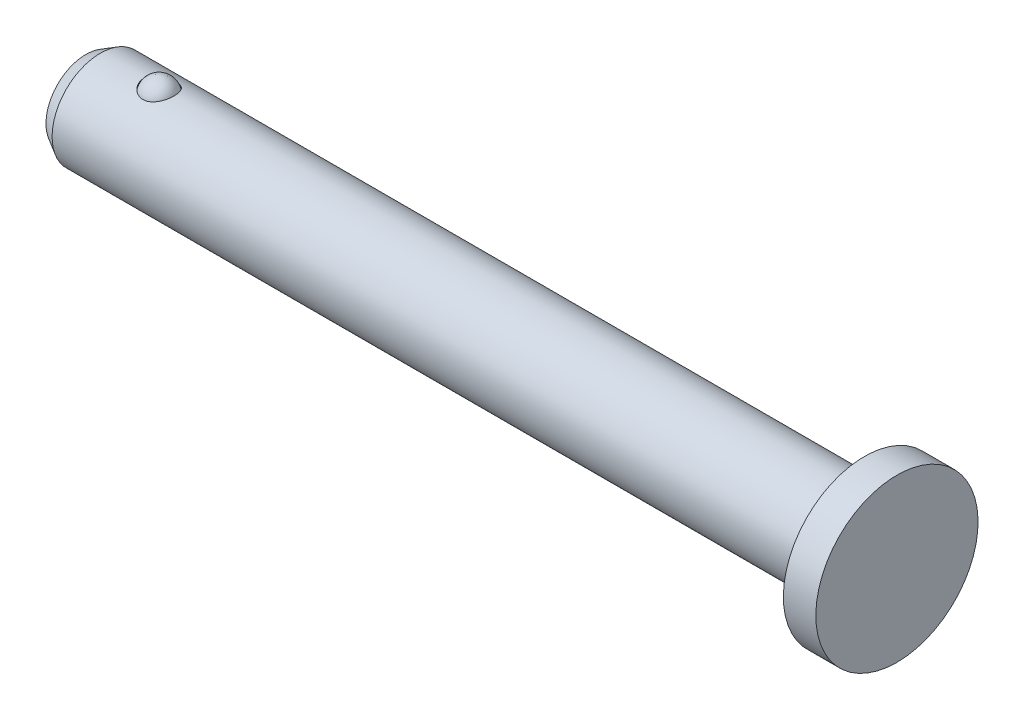
ISO-10303-21;
HEADER;
FILE_DESCRIPTION(('STEP AP214'),'2;1');
FILE_NAME('part.step','',(''),(''),'','','');
FILE_SCHEMA(('AUTOMOTIVE_DESIGN { 1 0 10303 214 1 1 1 1 }'));
ENDSEC;
DATA;
#1=APPLICATION_CONTEXT('core data for automotive mechanical design processes');
#2=APPLICATION_PROTOCOL_DEFINITION('international standard','automotive_design',2000,#1);
#3=PRODUCT_CONTEXT('',#1,'mechanical');
#4=PRODUCT('Part','Part','',(#3));
#5=PRODUCT_RELATED_PRODUCT_CATEGORY('part','',(#4));
#6=PRODUCT_DEFINITION_FORMATION('','',#4);
#7=PRODUCT_DEFINITION_CONTEXT('part definition',#1,'design');
#8=PRODUCT_DEFINITION('design','',#6,#7);
#9=PRODUCT_DEFINITION_SHAPE('','',#8);
#10=(LENGTH_UNIT() NAMED_UNIT(*) SI_UNIT(.MILLI.,.METRE.));
#11=(NAMED_UNIT(*) PLANE_ANGLE_UNIT() SI_UNIT($,.RADIAN.));
#12=(NAMED_UNIT(*) SI_UNIT($,.STERADIAN.) SOLID_ANGLE_UNIT());
#13=UNCERTAINTY_MEASURE_WITH_UNIT(LENGTH_MEASURE(1.E-05),#10,'distance_accuracy_value','');
#14=(GEOMETRIC_REPRESENTATION_CONTEXT(3) GLOBAL_UNCERTAINTY_ASSIGNED_CONTEXT((#13)) GLOBAL_UNIT_ASSIGNED_CONTEXT((#10,
#11,#12)) REPRESENTATION_CONTEXT('',''));
#15=CARTESIAN_POINT('',(0.,0.,0.));
#16=DIRECTION('',(0.,0.,1.));
#17=DIRECTION('',(1.,0.,0.));
#18=AXIS2_PLACEMENT_3D('',#15,#16,#17);
#19=CARTESIAN_POINT('',(-19.84375,0.,0.));
#20=DIRECTION('',(-1.,0.,0.));
#21=DIRECTION('',(0.,-1.,0.));
#22=AXIS2_PLACEMENT_3D('',#19,#20,#21);
#23=CYLINDRICAL_SURFACE('',#22,2.3622);
#24=CARTESIAN_POINT('',(-19.13509,0.,0.));
#25=DIRECTION('',(-1.,0.,0.));
#26=DIRECTION('',(0.,-1.,0.));
#27=AXIS2_PLACEMENT_3D('',#24,#25,#26);
#28=CIRCLE('',#27,2.3622);
#29=CARTESIAN_POINT('',(-19.13509,-2.3622,0.));
#30=VERTEX_POINT('',#29);
#31=EDGE_CURVE('P0_E27',#30,#30,#28,.T.);
#32=ORIENTED_EDGE('',*,*,#31,.F.);
#33=EDGE_LOOP('',(#32));
#34=FACE_BOUND('',#33,.T.);
#35=CARTESIAN_POINT('',(18.25625,0.,0.));
#36=DIRECTION('',(-1.,0.,0.));
#37=DIRECTION('',(0.,-1.,0.));
#38=AXIS2_PLACEMENT_3D('',#35,#36,#37);
#39=CIRCLE('',#38,2.3622);
#40=CARTESIAN_POINT('',(18.25625,-2.3622,0.));
#41=VERTEX_POINT('',#40);
#42=EDGE_CURVE('P0_E10',#41,#41,#39,.T.);
#43=ORIENTED_EDGE('',*,*,#42,.T.);
#44=EDGE_LOOP('',(#43));
#45=FACE_BOUND('',#44,.T.);
#46=CARTESIAN_POINT('',(-16.26235,2.22581604673215,-0.791032089178223));
#47=CARTESIAN_POINT('',(-16.3018338222643,2.22581576398312,-0.791032519638611));
#48=CARTESIAN_POINT('',(-16.3413151384197,2.22697971671572,-0.787780239460785));
#49=CARTESIAN_POINT('',(-16.4190911852111,2.23149491079169,-0.774896744356573));
#50=CARTESIAN_POINT('',(-16.4573858392532,2.2348462930174,-0.765265118565094));
#51=CARTESIAN_POINT('',(-16.531633713184,2.24333848583653,-0.739997800068515));
#52=CARTESIAN_POINT('',(-16.5675913296129,2.24847581373636,-0.724373786774381));
#53=CARTESIAN_POINT('',(-16.6363604141592,2.25998083212616,-0.687636848342259));
#54=CARTESIAN_POINT('',(-16.6691713829048,2.26634871742327,-0.666523053944658));
#55=CARTESIAN_POINT('',(-16.7319315200548,2.27988127975236,-0.618680689218365));
#56=CARTESIAN_POINT('',(-16.7617565640189,2.28706485050395,-0.59179497242801));
#57=CARTESIAN_POINT('',(-16.8167458077474,2.30133787147742,-0.533600878356375));
#58=CARTESIAN_POINT('',(-16.8419088865026,2.30842729868224,-0.502291440535603));
#59=CARTESIAN_POINT('',(-16.88866080437,2.32229610981989,-0.433849997368854));
#60=CARTESIAN_POINT('',(-16.9099016466427,2.32902369976236,-0.396469482014577));
#61=CARTESIAN_POINT('',(-16.9462545129409,2.34094584755715,-0.318610784362629));
#62=CARTESIAN_POINT('',(-16.9613651181152,2.34614005042941,-0.278131887514649));
#63=CARTESIAN_POINT('',(-16.9857004779035,2.3546627054261,-0.193473280151713));
#64=CARTESIAN_POINT('',(-16.9946653937695,2.35790814356074,-0.149210288520307));
#65=CARTESIAN_POINT('',(-17.005565894284,2.36186996349137,-0.0597154884593806));
#66=CARTESIAN_POINT('',(-17.0075008699652,2.36258612618922,-0.0144835964404188));
#67=CARTESIAN_POINT('',(-17.0042909971991,2.36141021290238,0.0762430533264944));
#68=CARTESIAN_POINT('',(-16.9990605263757,2.35948659277288,0.12173440739389));
#69=CARTESIAN_POINT('',(-16.9814508372294,2.35317206611294,0.211137527329617));
#70=CARTESIAN_POINT('',(-16.9690713024393,2.34878105035866,0.255049223179884));
#71=CARTESIAN_POINT('',(-16.9373785333382,2.33799474034002,0.340003755419017));
#72=CARTESIAN_POINT('',(-16.9180697195015,2.33160072420234,0.381048400920872));
#73=CARTESIAN_POINT('',(-16.8728542738949,2.31749884585933,0.459087628468663));
#74=CARTESIAN_POINT('',(-16.8469476298871,2.30979098121703,0.49608220300213));
#75=CARTESIAN_POINT('',(-16.7895191404422,2.2940716483114,0.564297213422603));
#76=CARTESIAN_POINT('',(-16.7580957761656,2.28606718272386,0.59560198834643));
#77=CARTESIAN_POINT('',(-16.6900563583582,2.27059247122217,0.65211919780701));
#78=CARTESIAN_POINT('',(-16.6534418764304,2.26312206464838,0.677333470010341));
#79=CARTESIAN_POINT('',(-16.5779492741709,2.25001785060625,0.719636287127462));
#80=CARTESIAN_POINT('',(-16.5392775456061,2.24431058256401,0.73706966099699));
#81=CARTESIAN_POINT('',(-16.4592512672779,2.23497292980211,0.764920542936363));
#82=CARTESIAN_POINT('',(-16.4178981594483,2.23134143896186,0.775341788088755));
#83=CARTESIAN_POINT('',(-16.336791790642,2.22680429519513,0.788273335332938));
#84=CARTESIAN_POINT('',(-16.2971273529941,2.2257265947787,0.791283526133024));
#85=CARTESIAN_POINT('',(-16.2178529464748,2.2259171339851,0.790747912230159));
#86=CARTESIAN_POINT('',(-16.1782429675224,2.227184856437,0.787203552820129));
#87=CARTESIAN_POINT('',(-16.101593807461,2.23183155461559,0.77392686631853));
#88=CARTESIAN_POINT('',(-16.0645129744794,2.23513795566731,0.764407057193666));
#89=CARTESIAN_POINT('',(-15.9924941222932,2.24343404277332,0.739703383423265));
#90=CARTESIAN_POINT('',(-15.9575563106065,2.24842389153994,0.724518971254892));
#91=CARTESIAN_POINT('',(-15.8896511257475,2.25973866548061,0.688430400089749));
#92=CARTESIAN_POINT('',(-15.8567728995766,2.26609879126542,0.667369988967333));
#93=CARTESIAN_POINT('',(-15.7948539005421,2.27941389290418,0.620368260180015));
#94=CARTESIAN_POINT('',(-15.7658141812176,2.28636903120949,0.594425607222328));
#95=CARTESIAN_POINT('',(-15.7103363875522,2.30067315029258,0.53650441012868));
#96=CARTESIAN_POINT('',(-15.6841940827522,2.30801802589022,0.504241497413384));
#97=CARTESIAN_POINT('',(-15.6373294223548,2.3219066096982,0.435840003810775));
#98=CARTESIAN_POINT('',(-15.6166085654881,2.32845009610334,0.399700355105054));
#99=CARTESIAN_POINT('',(-15.5799154074514,2.34044485511104,0.322365815909071));
#100=CARTESIAN_POINT('',(-15.5642733166028,2.34581462134006,0.281001264451536));
#101=CARTESIAN_POINT('',(-15.5396525932013,2.35443088539652,0.196122971548608));
#102=CARTESIAN_POINT('',(-15.5306749478103,2.35767706866266,0.152608912728051));
#103=CARTESIAN_POINT('',(-15.5193857562819,2.36177692867522,0.0635170638966761));
#104=CARTESIAN_POINT('',(-15.5172440137684,2.36256964717617,0.0179148433694454));
#105=CARTESIAN_POINT('',(-15.520139881845,2.3615088375365,-0.0730313594257117));
#106=CARTESIAN_POINT('',(-15.5251778997728,2.35965515925471,-0.118375326895323));
#107=CARTESIAN_POINT('',(-15.5423917858139,2.35347668943244,-0.207728305434119));
#108=CARTESIAN_POINT('',(-15.5545996260354,2.34914083140647,-0.251730402335729));
#109=CARTESIAN_POINT('',(-15.5859777734291,2.33844323829137,-0.33692140450069));
#110=CARTESIAN_POINT('',(-15.6051483348,2.33208142923882,-0.378110206989596));
#111=CARTESIAN_POINT('',(-15.6499743354645,2.31806542607961,-0.456209651369723));
#112=CARTESIAN_POINT('',(-15.6755888264204,2.31041949036449,-0.493145237461023));
#113=CARTESIAN_POINT('',(-15.7328670809521,2.29467177360045,-0.561885478042451));
#114=CARTESIAN_POINT('',(-15.7645302727704,2.28657003568757,-0.593690616967873));
#115=CARTESIAN_POINT('',(-15.8321103675284,2.27114006586694,-0.65018826947417));
#116=CARTESIAN_POINT('',(-15.8678630627565,2.26379555842983,-0.675072287191636));
#117=CARTESIAN_POINT('',(-15.9434509291089,2.25051576769323,-0.718107031490448));
#118=CARTESIAN_POINT('',(-15.9832838483709,2.24457971300892,-0.736261446834664));
#119=CARTESIAN_POINT('',(-16.0625351985796,2.23529527948482,-0.763964093369265));
#120=CARTESIAN_POINT('',(-16.1017351816544,2.23177879622831,-0.77408143316942));
#121=CARTESIAN_POINT('',(-16.1814079558051,2.22703972798425,-0.787614032349747));
#122=CARTESIAN_POINT('',(-16.221880294314,2.22581633654123,-0.79103164796954));
#123=CARTESIAN_POINT('',(-16.26235,2.22581604673215,-0.791032089178223));
#124=B_SPLINE_CURVE_WITH_KNOTS('',3,(#46,#47,#48,#49,#50,#51,#52,#53,#54,#55,#56,#57,#58,#59,
#60,#61,#62,#63,#64,#65,#66,#67,#68,#69,#70,#71,#72,#73,#74,#75,#76,#77,#78,#79,#80,#81,#82,#83,
#84,#85,#86,#87,#88,#89,#90,#91,#92,#93,#94,#95,#96,#97,#98,#99,#100,#101,#102,#103,#104,#105,
#106,#107,#108,#109,#110,#111,#112,#113,#114,#115,#116,#117,#118,#119,#120,#121,#122,#123),
.UNSPECIFIED.,.T.,.F.,(4,2,2,2,2,2,2,2,2,2,2,2,2,2,2,2,2,2,2,2,2,2,2,2,2,2,2,2,2,2,2,2,2,2,2,2,
2,2,4),(0.,0.118299361509028,0.236606342891336,0.354683901324815,0.472780167721913,
0.594630449676335,0.716509993647939,0.846477480289179,0.976475030932797,1.11167665655919,
1.24688999372124,1.38373321192027,1.52058248821507,1.65734461742627,1.79410700031295,
1.92863866932185,2.06312969570307,2.19085824756083,2.31851867302866,2.43729849240827,
2.55605212369601,2.6708045306772,2.78556803214262,2.90373452362426,3.02193338072498,
3.14788853933123,3.27387848087818,3.40691156896659,3.53996435847092,3.67629744685247,
3.81263827028837,3.94959173936421,4.08655020891101,4.22265943045034,4.35875579253439,
4.49059132495186,4.62235448583304,4.74365036609798,4.86490357990958),.UNSPECIFIED.);
#125=CARTESIAN_POINT('',(-16.26235,2.22581604673215,-0.791032089178223));
#126=VERTEX_POINT('',#125);
#127=EDGE_CURVE('P0_E19',#126,#126,#124,.T.);
#128=ORIENTED_EDGE('',*,*,#127,.F.);
#129=EDGE_LOOP('',(#128));
#130=FACE_BOUND('',#129,.T.);
#131=ADVANCED_FACE('P0_F15',(#34,#45,#130),#23,.T.);
#132=CARTESIAN_POINT('',(18.25625,2.3622,0.));
#133=DIRECTION('',(1.,0.,0.));
#134=DIRECTION('',(0.,1.,0.));
#135=AXIS2_PLACEMENT_3D('',#132,#133,#134);
#136=PLANE('',#135);
#137=ORIENTED_EDGE('',*,*,#42,.F.);
#138=EDGE_LOOP('',(#137));
#139=FACE_BOUND('',#138,.T.);
#140=CARTESIAN_POINT('',(18.25625,0.,0.));
#141=DIRECTION('',(-1.,0.,0.));
#142=DIRECTION('',(0.,-1.,0.));
#143=AXIS2_PLACEMENT_3D('',#140,#141,#142);
#144=CIRCLE('',#143,3.96875);
#145=CARTESIAN_POINT('',(18.25625,-3.96875,0.));
#146=VERTEX_POINT('',#145);
#147=EDGE_CURVE('P0_E39',#146,#146,#144,.T.);
#148=ORIENTED_EDGE('',*,*,#147,.T.);
#149=EDGE_LOOP('',(#148));
#150=FACE_BOUND('',#149,.T.);
#151=ADVANCED_FACE('P0_F17',(#139,#150),#136,.F.);
#152=CARTESIAN_POINT('',(-19.13509,0.,0.));
#153=DIRECTION('',(1.,0.,0.));
#154=DIRECTION('',(0.,1.,0.));
#155=AXIS2_PLACEMENT_3D('',#152,#153,#154);
#156=CONICAL_SURFACE('',#155,2.3622,0.523598775598299);
#157=CARTESIAN_POINT('',(-19.84375,0.,0.));
#158=DIRECTION('',(-1.,0.,0.));
#159=DIRECTION('',(0.,-1.,0.));
#160=AXIS2_PLACEMENT_3D('',#157,#158,#159);
#161=CIRCLE('',#160,1.95305495823608);
#162=CARTESIAN_POINT('',(-19.84375,-1.95305495823608,0.));
#163=VERTEX_POINT('',#162);
#164=EDGE_CURVE('P0_E31',#163,#163,#161,.T.);
#165=ORIENTED_EDGE('',*,*,#164,.F.);
#166=EDGE_LOOP('',(#165));
#167=FACE_BOUND('',#166,.T.);
#168=ORIENTED_EDGE('',*,*,#31,.T.);
#169=EDGE_LOOP('',(#168));
#170=FACE_BOUND('',#169,.T.);
#171=ADVANCED_FACE('P0_F54',(#167,#170),#156,.T.);
#172=CARTESIAN_POINT('',(-19.84375,1.95305495823608,0.));
#173=DIRECTION('',(1.,0.,0.));
#174=DIRECTION('',(0.,1.,0.));
#175=AXIS2_PLACEMENT_3D('',#172,#173,#174);
#176=PLANE('',#175);
#177=ORIENTED_EDGE('',*,*,#164,.T.);
#178=EDGE_LOOP('',(#177));
#179=FACE_BOUND('',#178,.T.);
#180=ADVANCED_FACE('P0_F61',(#179),#176,.F.);
#181=CARTESIAN_POINT('',(19.84375,3.96875,0.));
#182=DIRECTION('',(-1.,0.,0.));
#183=DIRECTION('',(0.,-1.,0.));
#184=AXIS2_PLACEMENT_3D('',#181,#182,#183);
#185=PLANE('',#184);
#186=CARTESIAN_POINT('',(19.84375,0.,0.));
#187=DIRECTION('',(-1.,0.,0.));
#188=DIRECTION('',(0.,-1.,0.));
#189=AXIS2_PLACEMENT_3D('',#186,#187,#188);
#190=CIRCLE('',#189,3.96875);
#191=CARTESIAN_POINT('',(19.84375,-3.96875,0.));
#192=VERTEX_POINT('',#191);
#193=EDGE_CURVE('P0_E36',#192,#192,#190,.T.);
#194=ORIENTED_EDGE('',*,*,#193,.F.);
#195=EDGE_LOOP('',(#194));
#196=FACE_BOUND('',#195,.T.);
#197=ADVANCED_FACE('P0_F65',(#196),#185,.F.);
#198=CARTESIAN_POINT('',(-19.84375,0.,0.));
#199=DIRECTION('',(-1.,0.,0.));
#200=DIRECTION('',(0.,-1.,0.));
#201=AXIS2_PLACEMENT_3D('',#198,#199,#200);
#202=CYLINDRICAL_SURFACE('',#201,3.96875);
#203=ORIENTED_EDGE('',*,*,#147,.F.);
#204=EDGE_LOOP('',(#203));
#205=FACE_BOUND('',#204,.T.);
#206=ORIENTED_EDGE('',*,*,#193,.T.);
#207=EDGE_LOOP('',(#206));
#208=FACE_BOUND('',#207,.T.);
#209=ADVANCED_FACE('P0_F69',(#205,#208),#202,.T.);
#210=CARTESIAN_POINT('',(-16.26235,2.02985730626251,0.));
#211=DIRECTION('',(-1.,0.,0.));
#212=DIRECTION('',(0.,1.,0.));
#213=AXIS2_PLACEMENT_3D('',#210,#211,#212);
#214=SPHERICAL_SURFACE('',#213,0.814942693737488);
#215=ORIENTED_EDGE('',*,*,#127,.T.);
#216=EDGE_LOOP('',(#215));
#217=FACE_BOUND('',#216,.T.);
#218=ADVANCED_FACE('P0_F46',(#217),#214,.F.);
#219=CLOSED_SHELL('',(#131,#151,#171,#180,#197,#209,#218));
#220=MANIFOLD_SOLID_BREP('P0_B1',#219);
#221=CARTESIAN_POINT('',(-16.26235,2.02985730626251,0.));
#222=DIRECTION('',(-1.,0.,0.));
#223=DIRECTION('',(0.,1.,0.));
#224=AXIS2_PLACEMENT_3D('',#221,#222,#223);
#225=SPHERICAL_SURFACE('',#224,0.789542693737488);
#226=CARTESIAN_POINT('',(-17.0518926937375,2.02985730626251,0.));
#227=VERTEX_POINT('',#226);
#228=VERTEX_LOOP('',#227);
#229=FACE_BOUND('',#228,.T.);
#230=ADVANCED_FACE('P1_F13',(#229),#225,.T.);
#231=CLOSED_SHELL('',(#230));
#232=MANIFOLD_SOLID_BREP('P1_B1',#231);
#233=ADVANCED_BREP_SHAPE_REPRESENTATION('',(#18,#220,#232),#14);
#234=SHAPE_DEFINITION_REPRESENTATION(#9,#233);
ENDSEC;
END-ISO-10303-21;
